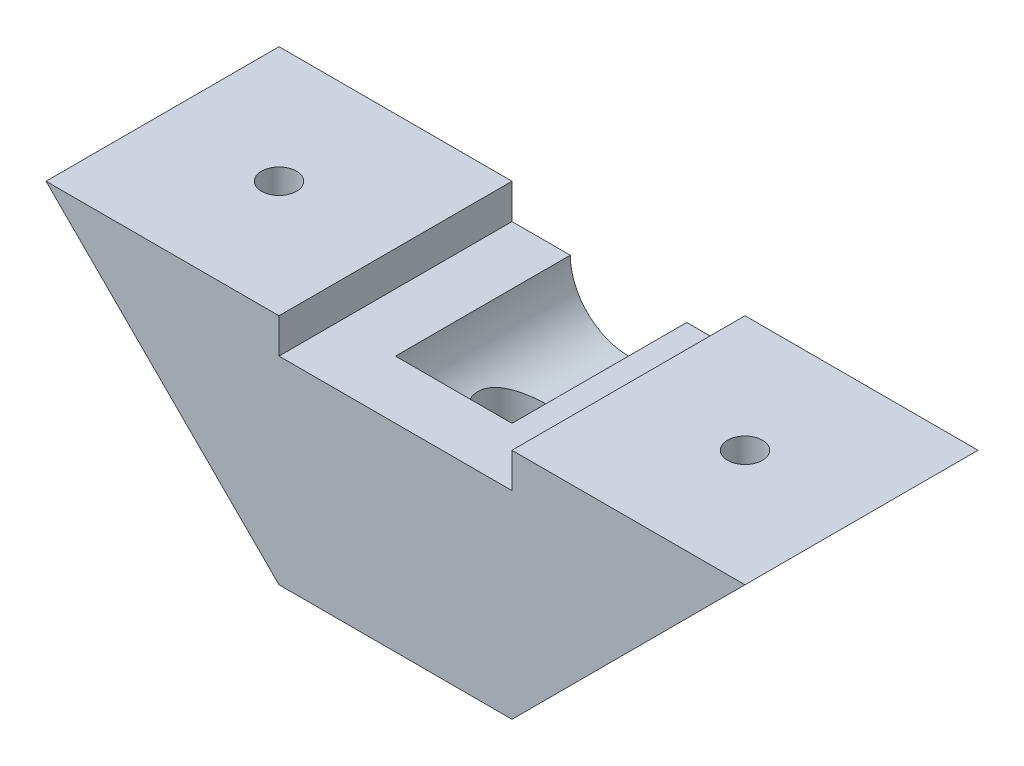
ISO-10303-21;
HEADER;
FILE_DESCRIPTION(('STEP AP214'),'2;1');
FILE_NAME('part.step','',(''),(''),'','','');
FILE_SCHEMA(('AUTOMOTIVE_DESIGN { 1 0 10303 214 1 1 1 1 }'));
ENDSEC;
DATA;
#1=APPLICATION_CONTEXT('core data for automotive mechanical design processes');
#2=APPLICATION_PROTOCOL_DEFINITION('international standard','automotive_design',2000,#1);
#3=PRODUCT_CONTEXT('',#1,'mechanical');
#4=PRODUCT('Part','Part','',(#3));
#5=PRODUCT_RELATED_PRODUCT_CATEGORY('part','',(#4));
#6=PRODUCT_DEFINITION_FORMATION('','',#4);
#7=PRODUCT_DEFINITION_CONTEXT('part definition',#1,'design');
#8=PRODUCT_DEFINITION('design','',#6,#7);
#9=PRODUCT_DEFINITION_SHAPE('','',#8);
#10=(LENGTH_UNIT() NAMED_UNIT(*) SI_UNIT(.MILLI.,.METRE.));
#11=(NAMED_UNIT(*) PLANE_ANGLE_UNIT() SI_UNIT($,.RADIAN.));
#12=(NAMED_UNIT(*) SI_UNIT($,.STERADIAN.) SOLID_ANGLE_UNIT());
#13=UNCERTAINTY_MEASURE_WITH_UNIT(LENGTH_MEASURE(1.E-05),#10,'distance_accuracy_value','');
#14=(GEOMETRIC_REPRESENTATION_CONTEXT(3) GLOBAL_UNCERTAINTY_ASSIGNED_CONTEXT((#13)) GLOBAL_UNIT_ASSIGNED_CONTEXT((#10,
#11,#12)) REPRESENTATION_CONTEXT('',''));
#15=CARTESIAN_POINT('',(0.,0.,0.));
#16=DIRECTION('',(0.,0.,1.));
#17=DIRECTION('',(1.,0.,0.));
#18=AXIS2_PLACEMENT_3D('',#15,#16,#17);
#19=CARTESIAN_POINT('',(10.,8.,10.));
#20=DIRECTION('',(0.,1.,0.));
#21=DIRECTION('',(0.,0.,1.));
#22=AXIS2_PLACEMENT_3D('',#19,#20,#21);
#23=CYLINDRICAL_SURFACE('',#22,1.5);
#24=CARTESIAN_POINT('',(10.,20.,10.));
#25=DIRECTION('',(0.,1.,0.));
#26=DIRECTION('',(0.,0.,1.));
#27=AXIS2_PLACEMENT_3D('',#24,#25,#26);
#28=CIRCLE('',#27,1.5);
#29=CARTESIAN_POINT('',(10.,20.,11.5));
#30=VERTEX_POINT('',#29);
#31=EDGE_CURVE('E225',#30,#30,#28,.T.);
#32=ORIENTED_EDGE('',*,*,#31,.T.);
#33=EDGE_LOOP('',(#32));
#34=FACE_BOUND('',#33,.T.);
#35=CARTESIAN_POINT('',(10.,15.,10.));
#36=DIRECTION('',(0.,-1.,0.));
#37=DIRECTION('',(0.,0.,-1.));
#38=AXIS2_PLACEMENT_3D('',#35,#36,#37);
#39=CIRCLE('',#38,1.5);
#40=CARTESIAN_POINT('',(10.,15.,8.5));
#41=VERTEX_POINT('',#40);
#42=EDGE_CURVE('E210',#41,#41,#39,.T.);
#43=ORIENTED_EDGE('',*,*,#42,.T.);
#44=EDGE_LOOP('',(#43));
#45=FACE_BOUND('',#44,.T.);
#46=ADVANCED_FACE('F41',(#34,#45),#23,.F.);
#47=CARTESIAN_POINT('',(50.,8.,10.));
#48=DIRECTION('',(0.,1.,0.));
#49=DIRECTION('',(0.,0.,1.));
#50=AXIS2_PLACEMENT_3D('',#47,#48,#49);
#51=CYLINDRICAL_SURFACE('',#50,1.5);
#52=CARTESIAN_POINT('',(50.,20.,10.));
#53=DIRECTION('',(0.,1.,0.));
#54=DIRECTION('',(0.,0.,1.));
#55=AXIS2_PLACEMENT_3D('',#52,#53,#54);
#56=CIRCLE('',#55,1.5);
#57=CARTESIAN_POINT('',(50.,20.,11.5));
#58=VERTEX_POINT('',#57);
#59=EDGE_CURVE('E272',#58,#58,#56,.T.);
#60=ORIENTED_EDGE('',*,*,#59,.T.);
#61=EDGE_LOOP('',(#60));
#62=FACE_BOUND('',#61,.T.);
#63=CARTESIAN_POINT('',(50.,15.,10.));
#64=DIRECTION('',(0.,-1.,0.));
#65=DIRECTION('',(0.,0.,-1.));
#66=AXIS2_PLACEMENT_3D('',#63,#64,#65);
#67=CIRCLE('',#66,1.5);
#68=CARTESIAN_POINT('',(50.,15.,8.49999999999999));
#69=VERTEX_POINT('',#68);
#70=EDGE_CURVE('E236',#69,#69,#67,.T.);
#71=ORIENTED_EDGE('',*,*,#70,.T.);
#72=EDGE_LOOP('',(#71));
#73=FACE_BOUND('',#72,.T.);
#74=ADVANCED_FACE('F390',(#62,#73),#51,.F.);
#75=CARTESIAN_POINT('',(30.,0.,10.));
#76=DIRECTION('',(0.,1.,0.));
#77=DIRECTION('',(0.,0.,1.));
#78=AXIS2_PLACEMENT_3D('',#75,#76,#77);
#79=CYLINDRICAL_SURFACE('',#78,1.6);
#80=CARTESIAN_POINT('',(30.,0.,10.));
#81=DIRECTION('',(0.,1.,0.));
#82=DIRECTION('',(0.,0.,1.));
#83=AXIS2_PLACEMENT_3D('',#80,#81,#82);
#84=CIRCLE('',#83,1.6);
#85=CARTESIAN_POINT('',(30.,0.,11.6));
#86=VERTEX_POINT('',#85);
#87=EDGE_CURVE('E284',#86,#86,#84,.T.);
#88=ORIENTED_EDGE('',*,*,#87,.F.);
#89=EDGE_LOOP('',(#88));
#90=FACE_BOUND('',#89,.T.);
#91=CARTESIAN_POINT('',(30.,8.,10.));
#92=DIRECTION('',(0.,1.,0.));
#93=DIRECTION('',(0.,0.,1.));
#94=AXIS2_PLACEMENT_3D('',#91,#92,#93);
#95=CIRCLE('',#94,1.6);
#96=CARTESIAN_POINT('',(30.,8.,11.6));
#97=VERTEX_POINT('',#96);
#98=EDGE_CURVE('E275',#97,#97,#95,.T.);
#99=ORIENTED_EDGE('',*,*,#98,.T.);
#100=EDGE_LOOP('',(#99));
#101=FACE_BOUND('',#100,.T.);
#102=ADVANCED_FACE('F387',(#90,#101),#79,.F.);
#103=CARTESIAN_POINT('',(10.,10.,15.));
#104=DIRECTION('',(0.707106781186547,0.707106781186547,0.));
#105=DIRECTION('',(-0.707106781186548,0.707106781186548,0.));
#106=AXIS2_PLACEMENT_3D('',#103,#104,#105);
#107=PLANE('',#106);
#108=DIRECTION('',(-0.654653670707977,0.654653670707977,-0.377964473009227));
#109=VECTOR('',#108,1.);
#110=CARTESIAN_POINT('',(12.0086077196921,7.99139228030794,8.04197875403658));
#111=LINE('',#110,#109);
#112=CARTESIAN_POINT('',(12.7,7.3,8.44115427318801));
#113=VERTEX_POINT('',#112);
#114=CARTESIAN_POINT('',(10.,9.99999999999999,6.88230854637602));
#115=VERTEX_POINT('',#114);
#116=EDGE_CURVE('E742',#113,#115,#111,.T.);
#117=ORIENTED_EDGE('',*,*,#116,.T.);
#118=DIRECTION('',(-0.654653670707977,0.654653670707977,0.377964473009227));
#119=VECTOR('',#118,1.);
#120=CARTESIAN_POINT('',(7.99139228030795,12.0086077196921,8.04197875403659));
#121=LINE('',#120,#119);
#122=CARTESIAN_POINT('',(7.3,12.7,8.44115427318801));
#123=VERTEX_POINT('',#122);
#124=EDGE_CURVE('E11',#115,#123,#121,.T.);
#125=ORIENTED_EDGE('',*,*,#124,.T.);
#126=DIRECTION('',(0.,0.,1.));
#127=VECTOR('',#126,1.);
#128=CARTESIAN_POINT('',(7.3,12.7,15.));
#129=LINE('',#128,#127);
#130=CARTESIAN_POINT('',(7.3,12.7,11.558845726812));
#131=VERTEX_POINT('',#130);
#132=EDGE_CURVE('E49',#123,#131,#129,.T.);
#133=ORIENTED_EDGE('',*,*,#132,.T.);
#134=DIRECTION('',(0.654653670707977,-0.654653670707977,0.377964473009227));
#135=VECTOR('',#134,1.);
#136=CARTESIAN_POINT('',(10.4657505768349,9.53424942316509,13.3865926745348));
#137=LINE('',#136,#135);
#138=CARTESIAN_POINT('',(10.,9.99999999999999,13.117691453624));
#139=VERTEX_POINT('',#138);
#140=EDGE_CURVE('E754',#131,#139,#137,.T.);
#141=ORIENTED_EDGE('',*,*,#140,.T.);
#142=DIRECTION('',(0.654653670707977,-0.654653670707977,-0.377964473009227));
#143=VECTOR('',#142,1.);
#144=CARTESIAN_POINT('',(9.53424942316509,10.4657505768349,13.3865926745348));
#145=LINE('',#144,#143);
#146=CARTESIAN_POINT('',(12.7,7.3,11.558845726812));
#147=VERTEX_POINT('',#146);
#148=EDGE_CURVE('E751',#139,#147,#145,.T.);
#149=ORIENTED_EDGE('',*,*,#148,.T.);
#150=DIRECTION('',(0.,0.,-1.));
#151=VECTOR('',#150,1.);
#152=CARTESIAN_POINT('',(12.7,7.3,15.));
#153=LINE('',#152,#151);
#154=EDGE_CURVE('E748',#147,#113,#153,.T.);
#155=ORIENTED_EDGE('',*,*,#154,.T.);
#156=EDGE_LOOP('',(#117,#125,#133,#141,#149,#155));
#157=FACE_BOUND('',#156,.T.);
#158=DIRECTION('',(0.707106781186548,-0.707106781186548,0.));
#159=VECTOR('',#158,1.);
#160=CARTESIAN_POINT('',(10.,10.,0.));
#161=LINE('',#160,#159);
#162=CARTESIAN_POINT('',(0.,20.,0.));
#163=VERTEX_POINT('',#162);
#164=CARTESIAN_POINT('',(20.,0.,0.));
#165=VERTEX_POINT('',#164);
#166=EDGE_CURVE('E312',#163,#165,#161,.T.);
#167=ORIENTED_EDGE('',*,*,#166,.T.);
#168=DIRECTION('',(0.,0.,-1.));
#169=VECTOR('',#168,1.);
#170=CARTESIAN_POINT('',(20.,0.,15.));
#171=LINE('',#170,#169);
#172=CARTESIAN_POINT('',(20.,0.,20.));
#173=VERTEX_POINT('',#172);
#174=EDGE_CURVE('E362',#173,#165,#171,.T.);
#175=ORIENTED_EDGE('',*,*,#174,.F.);
#176=DIRECTION('',(0.707106781186548,-0.707106781186548,0.));
#177=VECTOR('',#176,1.);
#178=CARTESIAN_POINT('',(10.,10.,20.));
#179=LINE('',#178,#177);
#180=CARTESIAN_POINT('',(0.,20.,20.));
#181=VERTEX_POINT('',#180);
#182=EDGE_CURVE('E297',#181,#173,#179,.T.);
#183=ORIENTED_EDGE('',*,*,#182,.F.);
#184=DIRECTION('',(0.,0.,-1.));
#185=VECTOR('',#184,1.);
#186=CARTESIAN_POINT('',(0.,20.,15.));
#187=LINE('',#186,#185);
#188=EDGE_CURVE('E317',#181,#163,#187,.T.);
#189=ORIENTED_EDGE('',*,*,#188,.T.);
#190=EDGE_LOOP('',(#167,#175,#183,#189));
#191=FACE_BOUND('',#190,.T.);
#192=ADVANCED_FACE('F43',(#157,#191),#107,.F.);
#193=CARTESIAN_POINT('',(0.,0.,15.));
#194=DIRECTION('',(0.,1.,0.));
#195=DIRECTION('',(0.,0.,1.));
#196=AXIS2_PLACEMENT_3D('',#193,#194,#195);
#197=PLANE('',#196);
#198=ORIENTED_EDGE('',*,*,#87,.T.);
#199=EDGE_LOOP('',(#198));
#200=FACE_BOUND('',#199,.T.);
#201=DIRECTION('',(1.,0.,0.));
#202=VECTOR('',#201,1.);
#203=CARTESIAN_POINT('',(0.,0.,0.));
#204=LINE('',#203,#202);
#205=CARTESIAN_POINT('',(40.,0.,0.));
#206=VERTEX_POINT('',#205);
#207=EDGE_CURVE('E321',#165,#206,#204,.T.);
#208=ORIENTED_EDGE('',*,*,#207,.T.);
#209=DIRECTION('',(0.,0.,-1.));
#210=VECTOR('',#209,1.);
#211=CARTESIAN_POINT('',(40.,0.,15.));
#212=LINE('',#211,#210);
#213=CARTESIAN_POINT('',(40.,0.,20.));
#214=VERTEX_POINT('',#213);
#215=EDGE_CURVE('E359',#214,#206,#212,.T.);
#216=ORIENTED_EDGE('',*,*,#215,.F.);
#217=DIRECTION('',(1.,0.,0.));
#218=VECTOR('',#217,1.);
#219=CARTESIAN_POINT('',(0.,0.,20.));
#220=LINE('',#219,#218);
#221=EDGE_CURVE('E300',#173,#214,#220,.T.);
#222=ORIENTED_EDGE('',*,*,#221,.F.);
#223=ORIENTED_EDGE('',*,*,#174,.T.);
#224=EDGE_LOOP('',(#208,#216,#222,#223));
#225=FACE_BOUND('',#224,.T.);
#226=ADVANCED_FACE('F541',(#200,#225),#197,.F.);
#227=CARTESIAN_POINT('',(20.,-20.,15.));
#228=DIRECTION('',(-0.707106781186547,0.707106781186547,0.));
#229=DIRECTION('',(-0.707106781186548,-0.707106781186548,0.));
#230=AXIS2_PLACEMENT_3D('',#227,#228,#229);
#231=PLANE('',#230);
#232=DIRECTION('',(-0.654653670707977,-0.654653670707977,-0.377964473009227));
#233=VECTOR('',#232,1.);
#234=CARTESIAN_POINT('',(26.2943220054063,-13.7056779945937,-6.80417102512521));
#235=LINE('',#234,#233);
#236=CARTESIAN_POINT('',(52.7,12.7,8.44115427318801));
#237=VERTEX_POINT('',#236);
#238=CARTESIAN_POINT('',(50.,10.,6.88230854637603));
#239=VERTEX_POINT('',#238);
#240=EDGE_CURVE('E365',#237,#239,#235,.T.);
#241=ORIENTED_EDGE('',*,*,#240,.T.);
#242=DIRECTION('',(-0.654653670707977,-0.654653670707977,0.377964473009227));
#243=VECTOR('',#242,1.);
#244=CARTESIAN_POINT('',(22.2771065660222,-17.7228934339778,22.8881285331984));
#245=LINE('',#244,#243);
#246=CARTESIAN_POINT('',(47.3,7.30000000000001,8.44115427318801));
#247=VERTEX_POINT('',#246);
#248=EDGE_CURVE('E729',#239,#247,#245,.T.);
#249=ORIENTED_EDGE('',*,*,#248,.T.);
#250=DIRECTION('',(0.,0.,1.));
#251=VECTOR('',#250,1.);
#252=CARTESIAN_POINT('',(47.3,7.30000000000001,15.));
#253=LINE('',#252,#251);
#254=CARTESIAN_POINT('',(47.3,7.3,11.558845726812));
#255=VERTEX_POINT('',#254);
#256=EDGE_CURVE('E740',#247,#255,#253,.T.);
#257=ORIENTED_EDGE('',*,*,#256,.T.);
#258=DIRECTION('',(0.654653670707977,0.654653670707977,0.377964473009227));
#259=VECTOR('',#258,1.);
#260=CARTESIAN_POINT('',(24.7514648625492,-15.2485351374508,-1.45955710462697));
#261=LINE('',#260,#259);
#262=CARTESIAN_POINT('',(50.,10.,13.117691453624));
#263=VERTEX_POINT('',#262);
#264=EDGE_CURVE('E738',#255,#263,#261,.T.);
#265=ORIENTED_EDGE('',*,*,#264,.T.);
#266=DIRECTION('',(0.654653670707977,0.654653670707977,-0.377964473009227));
#267=VECTOR('',#266,1.);
#268=CARTESIAN_POINT('',(23.8199637088794,-16.1800362911206,28.2327424536967));
#269=LINE('',#268,#267);
#270=CARTESIAN_POINT('',(52.7,12.7,11.558845726812));
#271=VERTEX_POINT('',#270);
#272=EDGE_CURVE('E736',#263,#271,#269,.T.);
#273=ORIENTED_EDGE('',*,*,#272,.T.);
#274=DIRECTION('',(0.,0.,-1.));
#275=VECTOR('',#274,1.);
#276=CARTESIAN_POINT('',(52.7,12.7,15.));
#277=LINE('',#276,#275);
#278=EDGE_CURVE('E759',#271,#237,#277,.T.);
#279=ORIENTED_EDGE('',*,*,#278,.T.);
#280=EDGE_LOOP('',(#241,#249,#257,#265,#273,#279));
#281=FACE_BOUND('',#280,.T.);
#282=DIRECTION('',(0.707106781186548,0.707106781186548,0.));
#283=VECTOR('',#282,1.);
#284=CARTESIAN_POINT('',(20.,-20.,0.));
#285=LINE('',#284,#283);
#286=CARTESIAN_POINT('',(60.,20.,0.));
#287=VERTEX_POINT('',#286);
#288=EDGE_CURVE('E323',#206,#287,#285,.T.);
#289=ORIENTED_EDGE('',*,*,#288,.T.);
#290=DIRECTION('',(0.,0.,-1.));
#291=VECTOR('',#290,1.);
#292=CARTESIAN_POINT('',(60.,20.,15.));
#293=LINE('',#292,#291);
#294=CARTESIAN_POINT('',(60.,20.,20.));
#295=VERTEX_POINT('',#294);
#296=EDGE_CURVE('E356',#295,#287,#293,.T.);
#297=ORIENTED_EDGE('',*,*,#296,.F.);
#298=DIRECTION('',(0.707106781186548,0.707106781186548,0.));
#299=VECTOR('',#298,1.);
#300=CARTESIAN_POINT('',(20.,-20.,20.));
#301=LINE('',#300,#299);
#302=EDGE_CURVE('E303',#214,#295,#301,.T.);
#303=ORIENTED_EDGE('',*,*,#302,.F.);
#304=ORIENTED_EDGE('',*,*,#215,.T.);
#305=EDGE_LOOP('',(#289,#297,#303,#304));
#306=FACE_BOUND('',#305,.T.);
#307=ADVANCED_FACE('F536',(#281,#306),#231,.F.);
#308=CARTESIAN_POINT('',(0.,20.,15.));
#309=DIRECTION('',(0.,-1.,0.));
#310=DIRECTION('',(0.,0.,-1.));
#311=AXIS2_PLACEMENT_3D('',#308,#309,#310);
#312=PLANE('',#311);
#313=ORIENTED_EDGE('',*,*,#59,.F.);
#314=EDGE_LOOP('',(#313));
#315=FACE_BOUND('',#314,.T.);
#316=DIRECTION('',(-1.,0.,0.));
#317=VECTOR('',#316,1.);
#318=CARTESIAN_POINT('',(0.,20.,0.));
#319=LINE('',#318,#317);
#320=CARTESIAN_POINT('',(40.,20.,0.));
#321=VERTEX_POINT('',#320);
#322=EDGE_CURVE('E325',#287,#321,#319,.T.);
#323=ORIENTED_EDGE('',*,*,#322,.T.);
#324=DIRECTION('',(0.,0.,-1.));
#325=VECTOR('',#324,1.);
#326=CARTESIAN_POINT('',(40.,20.,15.));
#327=LINE('',#326,#325);
#328=CARTESIAN_POINT('',(40.,20.,20.));
#329=VERTEX_POINT('',#328);
#330=EDGE_CURVE('E354',#329,#321,#327,.T.);
#331=ORIENTED_EDGE('',*,*,#330,.F.);
#332=DIRECTION('',(-1.,0.,0.));
#333=VECTOR('',#332,1.);
#334=CARTESIAN_POINT('',(0.,20.,20.));
#335=LINE('',#334,#333);
#336=EDGE_CURVE('E306',#295,#329,#335,.T.);
#337=ORIENTED_EDGE('',*,*,#336,.F.);
#338=ORIENTED_EDGE('',*,*,#296,.T.);
#339=EDGE_LOOP('',(#323,#331,#337,#338));
#340=FACE_BOUND('',#339,.T.);
#341=ADVANCED_FACE('F540',(#315,#340),#312,.F.);
#342=CARTESIAN_POINT('',(40.,0.,15.));
#343=DIRECTION('',(-1.,0.,0.));
#344=DIRECTION('',(0.,0.,1.));
#345=AXIS2_PLACEMENT_3D('',#342,#343,#344);
#346=PLANE('',#345);
#347=DIRECTION('',(0.,1.,0.));
#348=VECTOR('',#347,1.);
#349=CARTESIAN_POINT('',(40.,0.,0.));
#350=LINE('',#349,#348);
#351=CARTESIAN_POINT('',(40.,17.,0.));
#352=VERTEX_POINT('',#351);
#353=EDGE_CURVE('E328',#352,#321,#350,.T.);
#354=ORIENTED_EDGE('',*,*,#353,.F.);
#355=DIRECTION('',(0.,0.,-1.));
#356=VECTOR('',#355,1.);
#357=CARTESIAN_POINT('',(40.,17.,15.));
#358=LINE('',#357,#356);
#359=CARTESIAN_POINT('',(40.,17.,20.));
#360=VERTEX_POINT('',#359);
#361=EDGE_CURVE('E352',#360,#352,#358,.T.);
#362=ORIENTED_EDGE('',*,*,#361,.F.);
#363=DIRECTION('',(0.,-1.,0.));
#364=VECTOR('',#363,1.);
#365=CARTESIAN_POINT('',(40.,0.,20.));
#366=LINE('',#365,#364);
#367=EDGE_CURVE('E309',#329,#360,#366,.T.);
#368=ORIENTED_EDGE('',*,*,#367,.F.);
#369=ORIENTED_EDGE('',*,*,#330,.T.);
#370=EDGE_LOOP('',(#354,#362,#368,#369));
#371=FACE_BOUND('',#370,.T.);
#372=ADVANCED_FACE('F417',(#371),#346,.T.);
#373=CARTESIAN_POINT('',(30.,17.,15.));
#374=DIRECTION('',(0.,0.,-1.));
#375=DIRECTION('',(-1.,0.,0.));
#376=AXIS2_PLACEMENT_3D('',#373,#374,#375);
#377=CYLINDRICAL_SURFACE('',#376,5.);
#378=CARTESIAN_POINT('',(30.,12.,12.9));
#379=CARTESIAN_POINT('',(30.1491967729885,12.0000078224276,12.8999913460749));
#380=CARTESIAN_POINT('',(30.2986264408849,12.0067508486508,12.8884077247479));
#381=CARTESIAN_POINT('',(30.5930082905297,12.0330790732113,12.8426469701946));
#382=CARTESIAN_POINT('',(30.7379489397803,12.0526948709138,12.8084160012506));
#383=CARTESIAN_POINT('',(31.018497114166,12.1027686908275,12.7192324821387));
#384=CARTESIAN_POINT('',(31.15414546244,12.1331751009535,12.66437850002));
#385=CARTESIAN_POINT('',(31.4139363459503,12.2022009636197,12.5360979987518));
#386=CARTESIAN_POINT('',(31.5380814818383,12.2408185532358,12.4626756916055));
#387=CARTESIAN_POINT('',(31.781664167236,12.3262936552959,12.2933100388347));
#388=CARTESIAN_POINT('',(31.9000844787323,12.3735482435072,12.1961077527812));
#389=CARTESIAN_POINT('',(32.1199322401329,12.4700624205489,11.9847373353088));
#390=CARTESIAN_POINT('',(32.2213390565927,12.5193243551591,11.870548915618));
#391=CARTESIAN_POINT('',(32.4158529590917,12.6208458684022,11.6132347371063));
#392=CARTESIAN_POINT('',(32.5067342483687,12.6728169617182,11.4682978326821));
#393=CARTESIAN_POINT('',(32.6624688799267,12.7668478304549,11.1621658773871));
#394=CARTESIAN_POINT('',(32.7273624884822,12.8089228970678,11.0009964665533));
#395=CARTESIAN_POINT('',(32.8163777072555,12.8683896182247,10.7044411435723));
#396=CARTESIAN_POINT('',(32.8464140272687,12.8892179827822,10.571521429339));
#397=CARTESIAN_POINT('',(32.8875103509005,12.9179735144379,10.3014684479495));
#398=CARTESIAN_POINT('',(32.8985916322946,12.9259151468838,10.1643400814952));
#399=CARTESIAN_POINT('',(32.9011575774588,12.9277415563378,9.8895965138722));
#400=CARTESIAN_POINT('',(32.8926122756599,12.9216048387513,9.75198088899865));
#401=CARTESIAN_POINT('',(32.8563823026139,12.8961545569601,9.48051577211027));
#402=CARTESIAN_POINT('',(32.8286840858592,12.8768316672316,9.34666901531648));
#403=CARTESIAN_POINT('',(32.7557814436854,12.8277632684891,9.08688749178438));
#404=CARTESIAN_POINT('',(32.7106891581575,12.7980846377882,8.96090793014022));
#405=CARTESIAN_POINT('',(32.6045905167577,12.7315079345349,8.71792813864537));
#406=CARTESIAN_POINT('',(32.5435781450092,12.6946071341919,8.60093132486902));
#407=CARTESIAN_POINT('',(32.3957601862419,12.6103886970534,8.35877248774962));
#408=CARTESIAN_POINT('',(32.3063615576764,12.5623563591747,8.23543892636786));
#409=CARTESIAN_POINT('',(32.1095899817114,12.4654994103952,8.00432543209664));
#410=CARTESIAN_POINT('',(32.0022011241215,12.4166741330582,7.89655942533857));
#411=CARTESIAN_POINT('',(31.7568119959212,12.3167175495974,7.68641179652703));
#412=CARTESIAN_POINT('',(31.6166794606572,12.2660232288844,7.58626333756245));
#413=CARTESIAN_POINT('',(31.3932311386571,12.1973938528245,7.45512397166658));
#414=CARTESIAN_POINT('',(31.3165062260764,12.1757454539997,7.4145788070903));
#415=CARTESIAN_POINT('',(31.159081472292,12.1355257557736,7.34028386732338));
#416=CARTESIAN_POINT('',(31.0783840882797,12.1169525844463,7.3065299555068));
#417=CARTESIAN_POINT('',(30.9191360511687,12.0845809752751,7.24829349888882));
#418=CARTESIAN_POINT('',(30.8408052940449,12.0705456169954,7.2233404871752));
#419=CARTESIAN_POINT('',(30.6818202270122,12.0460535752699,7.18008810472819));
#420=CARTESIAN_POINT('',(30.6011672095802,12.0355949413633,7.16178510726534));
#421=CARTESIAN_POINT('',(30.4382338566437,12.0185694752224,7.13210891431779));
#422=CARTESIAN_POINT('',(30.3559545557186,12.012000246131,7.12073145083083));
#423=CARTESIAN_POINT('',(30.1905301129917,12.0029431940495,7.10507124530189));
#424=CARTESIAN_POINT('',(30.1073850762502,12.0004548815019,7.10078765226017));
#425=CARTESIAN_POINT('',(29.878775894024,11.9993657143691,7.09890051401778));
#426=CARTESIAN_POINT('',(29.7331404639224,12.0050554988166,7.10867416450532));
#427=CARTESIAN_POINT('',(29.4460608192358,12.0286869554136,7.14969806389365));
#428=CARTESIAN_POINT('',(29.3046166358029,12.0466287186037,7.18094847238148));
#429=CARTESIAN_POINT('',(29.0315172192145,12.0927651568574,7.26283397543997));
#430=CARTESIAN_POINT('',(28.899751694071,12.1208109773282,7.31318817393764));
#431=CARTESIAN_POINT('',(28.6464913104896,12.1849084087168,7.43142633889752));
#432=CARTESIAN_POINT('',(28.5249987902661,12.2209618354912,7.49931428199431));
#433=CARTESIAN_POINT('',(28.2820627539389,12.3024721137827,7.65864564021442));
#434=CARTESIAN_POINT('',(28.1619456970136,12.3485175128806,7.75180725912356));
#435=CARTESIAN_POINT('',(27.9381188824625,12.4433065652966,7.95511647923601));
#436=CARTESIAN_POINT('',(27.8344284240277,12.4920533029503,8.06528376443459));
#437=CARTESIAN_POINT('',(27.6339663568175,12.5936489065787,8.31465128925723));
#438=CARTESIAN_POINT('',(27.5394329006398,12.6463082635231,8.45574125697765));
#439=CARTESIAN_POINT('',(27.3755632722842,12.7430741040824,8.75450314740166));
#440=CARTESIAN_POINT('',(27.3061952738992,12.7871913575342,8.91215379830348));
#441=CARTESIAN_POINT('',(27.2077335269395,12.8519943451444,9.20518596609019));
#442=CARTESIAN_POINT('',(27.1731872970952,12.8756785586661,9.33806771323553));
#443=CARTESIAN_POINT('',(27.123201109898,12.910381173359,9.60892948063831));
#444=CARTESIAN_POINT('',(27.1077379607178,12.9214149475546,9.74690310214983));
#445=CARTESIAN_POINT('',(27.0967723715415,12.9292108704562,10.0244058132625));
#446=CARTESIAN_POINT('',(27.1013195456951,12.9259375458814,10.1639379125482));
#447=CARTESIAN_POINT('',(27.1302023085067,12.9055460737932,10.439932858843));
#448=CARTESIAN_POINT('',(27.1545501435988,12.8884193581848,10.5763937526613));
#449=CARTESIAN_POINT('',(27.2208355073017,12.8433452703158,10.8391360652439));
#450=CARTESIAN_POINT('',(27.2623017005193,12.8156892875505,10.9655894988164));
#451=CARTESIAN_POINT('',(27.3611893537542,12.7526352226072,11.2099912446638));
#452=CARTESIAN_POINT('',(27.4186165469057,12.71723435947,11.3279364816148));
#453=CARTESIAN_POINT('',(27.5580430428587,12.6360216929627,11.571452806652));
#454=CARTESIAN_POINT('',(27.6424697839631,12.5894465726805,11.6953788754869));
#455=CARTESIAN_POINT('',(27.8290256568137,12.4946885505621,11.9285204741627));
#456=CARTESIAN_POINT('',(27.9311709301296,12.4465042153358,12.0377224277067));
#457=CARTESIAN_POINT('',(28.1667148440012,12.3462287320863,12.2534214445048));
#458=CARTESIAN_POINT('',(28.3024746196016,12.2944973585844,12.3575312534252));
#459=CARTESIAN_POINT('',(28.5924493479444,12.1997936765973,12.5412954344658));
#460=CARTESIAN_POINT('',(28.7466538229842,12.1568164323926,12.6209636000766));
#461=CARTESIAN_POINT('',(29.0406865197232,12.0910049417381,12.740481337281));
#462=CARTESIAN_POINT('',(29.1781682982747,12.0659446041804,12.7848999258579));
#463=CARTESIAN_POINT('',(29.4595409141461,12.0272817295834,12.852844691061));
#464=CARTESIAN_POINT('',(29.6034128661518,12.0136475246734,12.8764286214721));
#465=CARTESIAN_POINT('',(29.7901608506058,12.0042278174257,12.8927048708583));
#466=CARTESIAN_POINT('',(29.8320585179662,12.0026451024192,12.8954375135458));
#467=CARTESIAN_POINT('',(29.9159646205239,12.0005300185761,12.8990864238813));
#468=CARTESIAN_POINT('',(29.9579730703791,11.9999977965166,12.9000024377062));
#469=CARTESIAN_POINT('',(30.,12.,12.9));
#470=B_SPLINE_CURVE_WITH_KNOTS('',3,(#378,#379,#380,#381,#382,#383,#384,#385,#386,#387,#388,
#389,#390,#391,#392,#393,#394,#395,#396,#397,#398,#399,#400,#401,#402,#403,#404,#405,#406,#407,
#408,#409,#410,#411,#412,#413,#414,#415,#416,#417,#418,#419,#420,#421,#422,#423,#424,#425,#426,
#427,#428,#429,#430,#431,#432,#433,#434,#435,#436,#437,#438,#439,#440,#441,#442,#443,#444,#445,
#446,#447,#448,#449,#450,#451,#452,#453,#454,#455,#456,#457,#458,#459,#460,#461,#462,#463,#464,
#465,#466,#467,#468,#469),.UNSPECIFIED.,.T.,.F.,(4,2,2,2,2,2,2,2,2,2,2,2,2,2,2,2,2,2,2,2,2,2,2,
2,2,2,2,2,2,2,2,2,2,2,2,2,2,2,2,2,2,2,2,2,2,4),(0.,0.447413964824487,0.895895331206737,
1.34225987460748,1.78852325621131,2.2675980237824,2.7472496632287,3.28099528463669,
3.81391067100087,4.22569525629178,4.6370172931255,5.04896774757999,5.46120984394625,
5.87083746707253,6.28062010487514,6.75788862556959,7.23558148283924,7.77113360988879,
8.03912763723573,8.30695792899624,8.5567980380324,8.80650168609388,9.05605129295394,
9.30557096100433,9.74142299283888,10.1772782633875,10.6069587476606,11.0367367687155,
11.5113354389487,11.986487632698,12.5173731172902,13.0475848425436,13.4637983421371,
13.8795055142713,14.2962439822285,14.713240393345,15.1194492164737,15.5258041373517,
15.9950511885486,16.4647279903217,16.9982748937395,17.5315201370124,17.9695902447882,
18.4064421746773,18.5324556810902,18.6584867931205),.UNSPECIFIED.);
#471=CARTESIAN_POINT('',(30.,12.,12.9));
#472=VERTEX_POINT('',#471);
#473=EDGE_CURVE('E283',#472,#472,#470,.T.);
#474=ORIENTED_EDGE('',*,*,#473,.F.);
#475=EDGE_LOOP('',(#474));
#476=FACE_BOUND('',#475,.T.);
#477=CARTESIAN_POINT('',(30.,17.,0.));
#478=DIRECTION('',(0.,0.,1.));
#479=DIRECTION('',(1.,0.,0.));
#480=AXIS2_PLACEMENT_3D('',#477,#478,#479);
#481=CIRCLE('',#480,5.);
#482=CARTESIAN_POINT('',(25.,17.,0.));
#483=VERTEX_POINT('',#482);
#484=CARTESIAN_POINT('',(35.,17.,0.));
#485=VERTEX_POINT('',#484);
#486=EDGE_CURVE('E334',#483,#485,#481,.T.);
#487=ORIENTED_EDGE('',*,*,#486,.F.);
#488=DIRECTION('',(0.,0.,-1.));
#489=VECTOR('',#488,1.);
#490=CARTESIAN_POINT('',(25.,17.,15.));
#491=LINE('',#490,#489);
#492=CARTESIAN_POINT('',(25.,17.,15.));
#493=VERTEX_POINT('',#492);
#494=EDGE_CURVE('E348',#493,#483,#491,.T.);
#495=ORIENTED_EDGE('',*,*,#494,.F.);
#496=CARTESIAN_POINT('',(30.,17.,15.));
#497=DIRECTION('',(0.,0.,1.));
#498=DIRECTION('',(1.,0.,0.));
#499=AXIS2_PLACEMENT_3D('',#496,#497,#498);
#500=CIRCLE('',#499,5.);
#501=CARTESIAN_POINT('',(35.,17.,15.));
#502=VERTEX_POINT('',#501);
#503=EDGE_CURVE('E314',#493,#502,#500,.T.);
#504=ORIENTED_EDGE('',*,*,#503,.T.);
#505=DIRECTION('',(0.,0.,-1.));
#506=VECTOR('',#505,1.);
#507=CARTESIAN_POINT('',(35.,17.,15.));
#508=LINE('',#507,#506);
#509=EDGE_CURVE('E350',#502,#485,#508,.T.);
#510=ORIENTED_EDGE('',*,*,#509,.T.);
#511=EDGE_LOOP('',(#487,#495,#504,#510));
#512=FACE_BOUND('',#511,.T.);
#513=ADVANCED_FACE('F374',(#476,#512),#377,.F.);
#514=CARTESIAN_POINT('',(0.,17.,15.));
#515=DIRECTION('',(0.,1.,0.));
#516=DIRECTION('',(0.,0.,1.));
#517=AXIS2_PLACEMENT_3D('',#514,#515,#516);
#518=PLANE('',#517);
#519=DIRECTION('',(1.,0.,0.));
#520=VECTOR('',#519,1.);
#521=CARTESIAN_POINT('',(0.,17.,0.));
#522=LINE('',#521,#520);
#523=CARTESIAN_POINT('',(20.,17.,0.));
#524=VERTEX_POINT('',#523);
#525=EDGE_CURVE('E335',#524,#483,#522,.T.);
#526=ORIENTED_EDGE('',*,*,#525,.F.);
#527=DIRECTION('',(0.,0.,-1.));
#528=VECTOR('',#527,1.);
#529=CARTESIAN_POINT('',(20.,17.,15.));
#530=LINE('',#529,#528);
#531=CARTESIAN_POINT('',(20.,17.,20.));
#532=VERTEX_POINT('',#531);
#533=EDGE_CURVE('E346',#532,#524,#530,.T.);
#534=ORIENTED_EDGE('',*,*,#533,.F.);
#535=DIRECTION('',(1.,0.,0.));
#536=VECTOR('',#535,1.);
#537=CARTESIAN_POINT('',(0.,17.,20.));
#538=LINE('',#537,#536);
#539=EDGE_CURVE('E288',#532,#360,#538,.T.);
#540=ORIENTED_EDGE('',*,*,#539,.T.);
#541=ORIENTED_EDGE('',*,*,#361,.T.);
#542=EDGE_CURVE('E331',#485,#352,#522,.T.);
#543=ORIENTED_EDGE('',*,*,#542,.F.);
#544=ORIENTED_EDGE('',*,*,#509,.F.);
#545=DIRECTION('',(1.,0.,0.));
#546=VECTOR('',#545,1.);
#547=CARTESIAN_POINT('',(0.,17.,15.));
#548=LINE('',#547,#546);
#549=EDGE_CURVE('E287',#493,#502,#548,.T.);
#550=ORIENTED_EDGE('',*,*,#549,.F.);
#551=ORIENTED_EDGE('',*,*,#494,.T.);
#552=EDGE_LOOP('',(#526,#534,#540,#541,#543,#544,#550,#551));
#553=FACE_BOUND('',#552,.T.);
#554=ADVANCED_FACE('F409',(#553),#518,.T.);
#555=CARTESIAN_POINT('',(20.,0.,15.));
#556=DIRECTION('',(-1.,0.,0.));
#557=DIRECTION('',(0.,0.,1.));
#558=AXIS2_PLACEMENT_3D('',#555,#556,#557);
#559=PLANE('',#558);
#560=DIRECTION('',(0.,1.,0.));
#561=VECTOR('',#560,1.);
#562=CARTESIAN_POINT('',(20.,0.,0.));
#563=LINE('',#562,#561);
#564=CARTESIAN_POINT('',(20.,20.,0.));
#565=VERTEX_POINT('',#564);
#566=EDGE_CURVE('E338',#524,#565,#563,.T.);
#567=ORIENTED_EDGE('',*,*,#566,.T.);
#568=DIRECTION('',(0.,0.,-1.));
#569=VECTOR('',#568,1.);
#570=CARTESIAN_POINT('',(20.,20.,15.));
#571=LINE('',#570,#569);
#572=CARTESIAN_POINT('',(20.,20.,20.));
#573=VERTEX_POINT('',#572);
#574=EDGE_CURVE('E344',#573,#565,#571,.T.);
#575=ORIENTED_EDGE('',*,*,#574,.F.);
#576=DIRECTION('',(0.,1.,0.));
#577=VECTOR('',#576,1.);
#578=CARTESIAN_POINT('',(20.,0.,20.));
#579=LINE('',#578,#577);
#580=EDGE_CURVE('E291',#532,#573,#579,.T.);
#581=ORIENTED_EDGE('',*,*,#580,.F.);
#582=ORIENTED_EDGE('',*,*,#533,.T.);
#583=EDGE_LOOP('',(#567,#575,#581,#582));
#584=FACE_BOUND('',#583,.T.);
#585=ADVANCED_FACE('F406',(#584),#559,.F.);
#586=CARTESIAN_POINT('',(0.,20.,15.));
#587=DIRECTION('',(0.,1.,0.));
#588=DIRECTION('',(0.,0.,1.));
#589=AXIS2_PLACEMENT_3D('',#586,#587,#588);
#590=PLANE('',#589);
#591=ORIENTED_EDGE('',*,*,#31,.F.);
#592=EDGE_LOOP('',(#591));
#593=FACE_BOUND('',#592,.T.);
#594=DIRECTION('',(1.,0.,0.));
#595=VECTOR('',#594,1.);
#596=CARTESIAN_POINT('',(0.,20.,0.));
#597=LINE('',#596,#595);
#598=EDGE_CURVE('E318',#163,#565,#597,.T.);
#599=ORIENTED_EDGE('',*,*,#598,.F.);
#600=ORIENTED_EDGE('',*,*,#188,.F.);
#601=DIRECTION('',(-1.,0.,0.));
#602=VECTOR('',#601,1.);
#603=CARTESIAN_POINT('',(0.,20.,20.));
#604=LINE('',#603,#602);
#605=EDGE_CURVE('E294',#573,#181,#604,.T.);
#606=ORIENTED_EDGE('',*,*,#605,.F.);
#607=ORIENTED_EDGE('',*,*,#574,.T.);
#608=EDGE_LOOP('',(#599,#600,#606,#607));
#609=FACE_BOUND('',#608,.T.);
#610=ADVANCED_FACE('F402',(#593,#609),#590,.T.);
#611=CARTESIAN_POINT('',(0.,0.,0.));
#612=DIRECTION('',(0.,0.,1.));
#613=DIRECTION('',(1.,0.,0.));
#614=AXIS2_PLACEMENT_3D('',#611,#612,#613);
#615=PLANE('',#614);
#616=ORIENTED_EDGE('',*,*,#166,.F.);
#617=ORIENTED_EDGE('',*,*,#598,.T.);
#618=ORIENTED_EDGE('',*,*,#566,.F.);
#619=ORIENTED_EDGE('',*,*,#525,.T.);
#620=ORIENTED_EDGE('',*,*,#486,.T.);
#621=ORIENTED_EDGE('',*,*,#542,.T.);
#622=ORIENTED_EDGE('',*,*,#353,.T.);
#623=ORIENTED_EDGE('',*,*,#322,.F.);
#624=ORIENTED_EDGE('',*,*,#288,.F.);
#625=ORIENTED_EDGE('',*,*,#207,.F.);
#626=EDGE_LOOP('',(#616,#617,#618,#619,#620,#621,#622,#623,#624,#625));
#627=FACE_BOUND('',#626,.T.);
#628=ADVANCED_FACE('F398',(#627),#615,.F.);
#629=CARTESIAN_POINT('',(0.,0.,15.));
#630=DIRECTION('',(0.,0.,1.));
#631=DIRECTION('',(1.,0.,0.));
#632=AXIS2_PLACEMENT_3D('',#629,#630,#631);
#633=PLANE('',#632);
#634=ORIENTED_EDGE('',*,*,#503,.F.);
#635=ORIENTED_EDGE('',*,*,#549,.T.);
#636=EDGE_LOOP('',(#634,#635));
#637=FACE_BOUND('',#636,.T.);
#638=ADVANCED_FACE('F394',(#637),#633,.F.);
#639=CARTESIAN_POINT('',(0.,0.,20.));
#640=DIRECTION('',(0.,0.,1.));
#641=DIRECTION('',(1.,0.,0.));
#642=AXIS2_PLACEMENT_3D('',#639,#640,#641);
#643=PLANE('',#642);
#644=ORIENTED_EDGE('',*,*,#539,.F.);
#645=ORIENTED_EDGE('',*,*,#580,.T.);
#646=ORIENTED_EDGE('',*,*,#605,.T.);
#647=ORIENTED_EDGE('',*,*,#182,.T.);
#648=ORIENTED_EDGE('',*,*,#221,.T.);
#649=ORIENTED_EDGE('',*,*,#302,.T.);
#650=ORIENTED_EDGE('',*,*,#336,.T.);
#651=ORIENTED_EDGE('',*,*,#367,.T.);
#652=EDGE_LOOP('',(#644,#645,#646,#647,#648,#649,#650,#651));
#653=FACE_BOUND('',#652,.T.);
#654=ADVANCED_FACE('F384',(#653),#643,.T.);
#655=CARTESIAN_POINT('',(30.,8.,10.));
#656=DIRECTION('',(0.,1.,0.));
#657=DIRECTION('',(0.,0.,1.));
#658=AXIS2_PLACEMENT_3D('',#655,#656,#657);
#659=CYLINDRICAL_SURFACE('',#658,2.9);
#660=ORIENTED_EDGE('',*,*,#473,.T.);
#661=EDGE_LOOP('',(#660));
#662=FACE_BOUND('',#661,.T.);
#663=CARTESIAN_POINT('',(30.,8.,10.));
#664=DIRECTION('',(0.,1.,0.));
#665=DIRECTION('',(0.,0.,1.));
#666=AXIS2_PLACEMENT_3D('',#663,#664,#665);
#667=CIRCLE('',#666,2.9);
#668=CARTESIAN_POINT('',(30.,8.,12.9));
#669=VERTEX_POINT('',#668);
#670=EDGE_CURVE('E280',#669,#669,#667,.T.);
#671=ORIENTED_EDGE('',*,*,#670,.F.);
#672=EDGE_LOOP('',(#671));
#673=FACE_BOUND('',#672,.T.);
#674=ADVANCED_FACE('F378',(#662,#673),#659,.F.);
#675=CARTESIAN_POINT('',(30.,8.,10.));
#676=DIRECTION('',(0.,1.,0.));
#677=DIRECTION('',(0.,0.,1.));
#678=AXIS2_PLACEMENT_3D('',#675,#676,#677);
#679=PLANE('',#678);
#680=ORIENTED_EDGE('',*,*,#98,.F.);
#681=EDGE_LOOP('',(#680));
#682=FACE_BOUND('',#681,.T.);
#683=ORIENTED_EDGE('',*,*,#670,.T.);
#684=EDGE_LOOP('',(#683));
#685=FACE_BOUND('',#684,.T.);
#686=ADVANCED_FACE('F383',(#682,#685),#679,.T.);
#687=CARTESIAN_POINT('',(47.3,15.,8.44115427318801));
#688=DIRECTION('',(-0.5,0.,-0.866025403784438));
#689=DIRECTION('',(-0.866025403784439,0.,0.5));
#690=AXIS2_PLACEMENT_3D('',#687,#688,#689);
#691=PLANE('',#690);
#692=DIRECTION('',(0.,-1.,0.));
#693=VECTOR('',#692,1.);
#694=CARTESIAN_POINT('',(50.,15.,6.88230854637602));
#695=LINE('',#694,#693);
#696=CARTESIAN_POINT('',(50.,15.,6.88230854637602));
#697=VERTEX_POINT('',#696);
#698=EDGE_CURVE('E64',#697,#239,#695,.T.);
#699=ORIENTED_EDGE('',*,*,#698,.F.);
#700=DIRECTION('',(0.866025403784438,0.,-0.5));
#701=VECTOR('',#700,1.);
#702=CARTESIAN_POINT('',(47.3,15.,8.44115427318801));
#703=LINE('',#702,#701);
#704=CARTESIAN_POINT('',(47.3,15.,8.44115427318801));
#705=VERTEX_POINT('',#704);
#706=EDGE_CURVE('E239',#705,#697,#703,.T.);
#707=ORIENTED_EDGE('',*,*,#706,.F.);
#708=DIRECTION('',(0.,-1.,0.));
#709=VECTOR('',#708,1.);
#710=CARTESIAN_POINT('',(47.3,15.,8.44115427318801));
#711=LINE('',#710,#709);
#712=EDGE_CURVE('E213',#705,#247,#711,.T.);
#713=ORIENTED_EDGE('',*,*,#712,.T.);
#714=ORIENTED_EDGE('',*,*,#248,.F.);
#715=EDGE_LOOP('',(#699,#707,#713,#714));
#716=FACE_BOUND('',#715,.T.);
#717=ADVANCED_FACE('F429',(#716),#691,.F.);
#718=CARTESIAN_POINT('',(47.3,15.,11.558845726812));
#719=DIRECTION('',(-1.,0.,0.));
#720=DIRECTION('',(0.,0.,1.));
#721=AXIS2_PLACEMENT_3D('',#718,#719,#720);
#722=PLANE('',#721);
#723=ORIENTED_EDGE('',*,*,#712,.F.);
#724=DIRECTION('',(0.,0.,-1.));
#725=VECTOR('',#724,1.);
#726=CARTESIAN_POINT('',(47.3,15.,11.558845726812));
#727=LINE('',#726,#725);
#728=CARTESIAN_POINT('',(47.3,15.,11.558845726812));
#729=VERTEX_POINT('',#728);
#730=EDGE_CURVE('E254',#729,#705,#727,.T.);
#731=ORIENTED_EDGE('',*,*,#730,.F.);
#732=DIRECTION('',(0.,-1.,0.));
#733=VECTOR('',#732,1.);
#734=CARTESIAN_POINT('',(47.3,15.,11.558845726812));
#735=LINE('',#734,#733);
#736=EDGE_CURVE('E259',#729,#255,#735,.T.);
#737=ORIENTED_EDGE('',*,*,#736,.T.);
#738=ORIENTED_EDGE('',*,*,#256,.F.);
#739=EDGE_LOOP('',(#723,#731,#737,#738));
#740=FACE_BOUND('',#739,.T.);
#741=ADVANCED_FACE('F432',(#740),#722,.F.);
#742=CARTESIAN_POINT('',(50.,15.,13.117691453624));
#743=DIRECTION('',(-0.5,0.,0.866025403784439));
#744=DIRECTION('',(0.866025403784439,0.,0.5));
#745=AXIS2_PLACEMENT_3D('',#742,#743,#744);
#746=PLANE('',#745);
#747=ORIENTED_EDGE('',*,*,#736,.F.);
#748=DIRECTION('',(-0.866025403784439,0.,-0.5));
#749=VECTOR('',#748,1.);
#750=CARTESIAN_POINT('',(50.,15.,13.117691453624));
#751=LINE('',#750,#749);
#752=CARTESIAN_POINT('',(50.,15.,13.117691453624));
#753=VERTEX_POINT('',#752);
#754=EDGE_CURVE('E251',#753,#729,#751,.T.);
#755=ORIENTED_EDGE('',*,*,#754,.F.);
#756=DIRECTION('',(0.,-1.,0.));
#757=VECTOR('',#756,1.);
#758=CARTESIAN_POINT('',(50.,15.,13.117691453624));
#759=LINE('',#758,#757);
#760=EDGE_CURVE('E262',#753,#263,#759,.T.);
#761=ORIENTED_EDGE('',*,*,#760,.T.);
#762=ORIENTED_EDGE('',*,*,#264,.F.);
#763=EDGE_LOOP('',(#747,#755,#761,#762));
#764=FACE_BOUND('',#763,.T.);
#765=ADVANCED_FACE('F445',(#764),#746,.F.);
#766=CARTESIAN_POINT('',(52.7,15.,11.558845726812));
#767=DIRECTION('',(0.5,0.,0.866025403784439));
#768=DIRECTION('',(0.866025403784439,0.,-0.5));
#769=AXIS2_PLACEMENT_3D('',#766,#767,#768);
#770=PLANE('',#769);
#771=ORIENTED_EDGE('',*,*,#760,.F.);
#772=DIRECTION('',(-0.866025403784439,0.,0.5));
#773=VECTOR('',#772,1.);
#774=CARTESIAN_POINT('',(52.7,15.,11.558845726812));
#775=LINE('',#774,#773);
#776=CARTESIAN_POINT('',(52.7,15.,11.558845726812));
#777=VERTEX_POINT('',#776);
#778=EDGE_CURVE('E248',#777,#753,#775,.T.);
#779=ORIENTED_EDGE('',*,*,#778,.F.);
#780=DIRECTION('',(0.,-1.,0.));
#781=VECTOR('',#780,1.);
#782=CARTESIAN_POINT('',(52.7,15.,11.558845726812));
#783=LINE('',#782,#781);
#784=EDGE_CURVE('E265',#777,#271,#783,.T.);
#785=ORIENTED_EDGE('',*,*,#784,.T.);
#786=ORIENTED_EDGE('',*,*,#272,.F.);
#787=EDGE_LOOP('',(#771,#779,#785,#786));
#788=FACE_BOUND('',#787,.T.);
#789=ADVANCED_FACE('F441',(#788),#770,.F.);
#790=CARTESIAN_POINT('',(52.7,15.,8.44115427318801));
#791=DIRECTION('',(1.,0.,0.));
#792=DIRECTION('',(0.,0.,-1.));
#793=AXIS2_PLACEMENT_3D('',#790,#791,#792);
#794=PLANE('',#793);
#795=ORIENTED_EDGE('',*,*,#784,.F.);
#796=DIRECTION('',(0.,0.,1.));
#797=VECTOR('',#796,1.);
#798=CARTESIAN_POINT('',(52.7,15.,8.44115427318801));
#799=LINE('',#798,#797);
#800=CARTESIAN_POINT('',(52.7,15.,8.44115427318801));
#801=VERTEX_POINT('',#800);
#802=EDGE_CURVE('E245',#801,#777,#799,.T.);
#803=ORIENTED_EDGE('',*,*,#802,.F.);
#804=DIRECTION('',(0.,-1.,0.));
#805=VECTOR('',#804,1.);
#806=CARTESIAN_POINT('',(52.7,15.,8.44115427318801));
#807=LINE('',#806,#805);
#808=EDGE_CURVE('E268',#801,#237,#807,.T.);
#809=ORIENTED_EDGE('',*,*,#808,.T.);
#810=ORIENTED_EDGE('',*,*,#278,.F.);
#811=EDGE_LOOP('',(#795,#803,#809,#810));
#812=FACE_BOUND('',#811,.T.);
#813=ADVANCED_FACE('F438',(#812),#794,.F.);
#814=CARTESIAN_POINT('',(50.,15.,6.88230854637602));
#815=DIRECTION('',(0.5,0.,-0.866025403784439));
#816=DIRECTION('',(-0.866025403784439,0.,-0.5));
#817=AXIS2_PLACEMENT_3D('',#814,#815,#816);
#818=PLANE('',#817);
#819=ORIENTED_EDGE('',*,*,#808,.F.);
#820=DIRECTION('',(0.866025403784439,0.,0.5));
#821=VECTOR('',#820,1.);
#822=CARTESIAN_POINT('',(50.,15.,6.88230854637602));
#823=LINE('',#822,#821);
#824=EDGE_CURVE('E242',#697,#801,#823,.T.);
#825=ORIENTED_EDGE('',*,*,#824,.F.);
#826=ORIENTED_EDGE('',*,*,#698,.T.);
#827=ORIENTED_EDGE('',*,*,#240,.F.);
#828=EDGE_LOOP('',(#819,#825,#826,#827));
#829=FACE_BOUND('',#828,.T.);
#830=ADVANCED_FACE('F434',(#829),#818,.F.);
#831=CARTESIAN_POINT('',(0.,15.,0.));
#832=DIRECTION('',(0.,-1.,0.));
#833=DIRECTION('',(0.,0.,-1.));
#834=AXIS2_PLACEMENT_3D('',#831,#832,#833);
#835=PLANE('',#834);
#836=ORIENTED_EDGE('',*,*,#70,.F.);
#837=EDGE_LOOP('',(#836));
#838=FACE_BOUND('',#837,.T.);
#839=ORIENTED_EDGE('',*,*,#706,.T.);
#840=ORIENTED_EDGE('',*,*,#824,.T.);
#841=ORIENTED_EDGE('',*,*,#802,.T.);
#842=ORIENTED_EDGE('',*,*,#778,.T.);
#843=ORIENTED_EDGE('',*,*,#754,.T.);
#844=ORIENTED_EDGE('',*,*,#730,.T.);
#845=EDGE_LOOP('',(#839,#840,#841,#842,#843,#844));
#846=FACE_BOUND('',#845,.T.);
#847=ADVANCED_FACE('F437',(#838,#846),#835,.T.);
#848=CARTESIAN_POINT('',(7.3,15.,8.44115427318801));
#849=DIRECTION('',(-0.5,0.,-0.866025403784439));
#850=DIRECTION('',(-0.866025403784439,0.,0.5));
#851=AXIS2_PLACEMENT_3D('',#848,#849,#850);
#852=PLANE('',#851);
#853=DIRECTION('',(0.,-1.,0.));
#854=VECTOR('',#853,1.);
#855=CARTESIAN_POINT('',(10.,15.,6.88230854637602));
#856=LINE('',#855,#854);
#857=CARTESIAN_POINT('',(10.,15.,6.88230854637602));
#858=VERTEX_POINT('',#857);
#859=EDGE_CURVE('E56',#858,#115,#856,.T.);
#860=ORIENTED_EDGE('',*,*,#859,.F.);
#861=DIRECTION('',(0.866025403784439,0.,-0.5));
#862=VECTOR('',#861,1.);
#863=CARTESIAN_POINT('',(7.3,15.,8.44115427318801));
#864=LINE('',#863,#862);
#865=CARTESIAN_POINT('',(7.3,15.,8.44115427318801));
#866=VERTEX_POINT('',#865);
#867=EDGE_CURVE('E192',#866,#858,#864,.T.);
#868=ORIENTED_EDGE('',*,*,#867,.F.);
#869=DIRECTION('',(0.,-1.,0.));
#870=VECTOR('',#869,1.);
#871=CARTESIAN_POINT('',(7.3,15.,8.44115427318801));
#872=LINE('',#871,#870);
#873=EDGE_CURVE('E223',#866,#123,#872,.T.);
#874=ORIENTED_EDGE('',*,*,#873,.T.);
#875=ORIENTED_EDGE('',*,*,#124,.F.);
#876=EDGE_LOOP('',(#860,#868,#874,#875));
#877=FACE_BOUND('',#876,.T.);
#878=ADVANCED_FACE('F189',(#877),#852,.F.);
#879=CARTESIAN_POINT('',(7.3,15.,11.558845726812));
#880=DIRECTION('',(-1.,0.,0.));
#881=DIRECTION('',(0.,0.,1.));
#882=AXIS2_PLACEMENT_3D('',#879,#880,#881);
#883=PLANE('',#882);
#884=ORIENTED_EDGE('',*,*,#873,.F.);
#885=DIRECTION('',(0.,0.,-1.));
#886=VECTOR('',#885,1.);
#887=CARTESIAN_POINT('',(7.3,15.,11.558845726812));
#888=LINE('',#887,#886);
#889=CARTESIAN_POINT('',(7.3,15.,11.558845726812));
#890=VERTEX_POINT('',#889);
#891=EDGE_CURVE('E196',#890,#866,#888,.T.);
#892=ORIENTED_EDGE('',*,*,#891,.F.);
#893=DIRECTION('',(0.,-1.,0.));
#894=VECTOR('',#893,1.);
#895=CARTESIAN_POINT('',(7.3,15.,11.558845726812));
#896=LINE('',#895,#894);
#897=EDGE_CURVE('E226',#890,#131,#896,.T.);
#898=ORIENTED_EDGE('',*,*,#897,.T.);
#899=ORIENTED_EDGE('',*,*,#132,.F.);
#900=EDGE_LOOP('',(#884,#892,#898,#899));
#901=FACE_BOUND('',#900,.T.);
#902=ADVANCED_FACE('F458',(#901),#883,.F.);
#903=CARTESIAN_POINT('',(10.,15.,13.117691453624));
#904=DIRECTION('',(-0.5,0.,0.866025403784438));
#905=DIRECTION('',(0.866025403784439,0.,0.5));
#906=AXIS2_PLACEMENT_3D('',#903,#904,#905);
#907=PLANE('',#906);
#908=ORIENTED_EDGE('',*,*,#897,.F.);
#909=DIRECTION('',(-0.866025403784438,0.,-0.5));
#910=VECTOR('',#909,1.);
#911=CARTESIAN_POINT('',(10.,15.,13.117691453624));
#912=LINE('',#911,#910);
#913=CARTESIAN_POINT('',(10.,15.,13.117691453624));
#914=VERTEX_POINT('',#913);
#915=EDGE_CURVE('E220',#914,#890,#912,.T.);
#916=ORIENTED_EDGE('',*,*,#915,.F.);
#917=DIRECTION('',(0.,-1.,0.));
#918=VECTOR('',#917,1.);
#919=CARTESIAN_POINT('',(10.,15.,13.117691453624));
#920=LINE('',#919,#918);
#921=EDGE_CURVE('E229',#914,#139,#920,.T.);
#922=ORIENTED_EDGE('',*,*,#921,.T.);
#923=ORIENTED_EDGE('',*,*,#140,.F.);
#924=EDGE_LOOP('',(#908,#916,#922,#923));
#925=FACE_BOUND('',#924,.T.);
#926=ADVANCED_FACE('F468',(#925),#907,.F.);
#927=CARTESIAN_POINT('',(12.7,15.,11.558845726812));
#928=DIRECTION('',(0.5,0.,0.866025403784439));
#929=DIRECTION('',(0.866025403784439,0.,-0.5));
#930=AXIS2_PLACEMENT_3D('',#927,#928,#929);
#931=PLANE('',#930);
#932=ORIENTED_EDGE('',*,*,#921,.F.);
#933=DIRECTION('',(-0.866025403784439,0.,0.5));
#934=VECTOR('',#933,1.);
#935=CARTESIAN_POINT('',(12.7,15.,11.558845726812));
#936=LINE('',#935,#934);
#937=CARTESIAN_POINT('',(12.7,15.,11.558845726812));
#938=VERTEX_POINT('',#937);
#939=EDGE_CURVE('E217',#938,#914,#936,.T.);
#940=ORIENTED_EDGE('',*,*,#939,.F.);
#941=DIRECTION('',(0.,-1.,0.));
#942=VECTOR('',#941,1.);
#943=CARTESIAN_POINT('',(12.7,15.,11.558845726812));
#944=LINE('',#943,#942);
#945=EDGE_CURVE('E232',#938,#147,#944,.T.);
#946=ORIENTED_EDGE('',*,*,#945,.T.);
#947=ORIENTED_EDGE('',*,*,#148,.F.);
#948=EDGE_LOOP('',(#932,#940,#946,#947));
#949=FACE_BOUND('',#948,.T.);
#950=ADVANCED_FACE('F464',(#949),#931,.F.);
#951=CARTESIAN_POINT('',(12.7,15.,8.44115427318801));
#952=DIRECTION('',(1.,0.,0.));
#953=DIRECTION('',(0.,0.,-1.));
#954=AXIS2_PLACEMENT_3D('',#951,#952,#953);
#955=PLANE('',#954);
#956=ORIENTED_EDGE('',*,*,#945,.F.);
#957=DIRECTION('',(0.,0.,1.));
#958=VECTOR('',#957,1.);
#959=CARTESIAN_POINT('',(12.7,15.,8.44115427318801));
#960=LINE('',#959,#958);
#961=CARTESIAN_POINT('',(12.7,15.,8.44115427318801));
#962=VERTEX_POINT('',#961);
#963=EDGE_CURVE('E205',#962,#938,#960,.T.);
#964=ORIENTED_EDGE('',*,*,#963,.F.);
#965=DIRECTION('',(0.,-1.,0.));
#966=VECTOR('',#965,1.);
#967=CARTESIAN_POINT('',(12.7,15.,8.44115427318801));
#968=LINE('',#967,#966);
#969=EDGE_CURVE('E195',#962,#113,#968,.T.);
#970=ORIENTED_EDGE('',*,*,#969,.T.);
#971=ORIENTED_EDGE('',*,*,#154,.F.);
#972=EDGE_LOOP('',(#956,#964,#970,#971));
#973=FACE_BOUND('',#972,.T.);
#974=ADVANCED_FACE('F461',(#973),#955,.F.);
#975=CARTESIAN_POINT('',(10.,15.,6.88230854637602));
#976=DIRECTION('',(0.5,0.,-0.866025403784439));
#977=DIRECTION('',(-0.866025403784439,0.,-0.5));
#978=AXIS2_PLACEMENT_3D('',#975,#976,#977);
#979=PLANE('',#978);
#980=ORIENTED_EDGE('',*,*,#969,.F.);
#981=DIRECTION('',(0.866025403784439,0.,0.5));
#982=VECTOR('',#981,1.);
#983=CARTESIAN_POINT('',(10.,15.,6.88230854637602));
#984=LINE('',#983,#982);
#985=EDGE_CURVE('E199',#858,#962,#984,.T.);
#986=ORIENTED_EDGE('',*,*,#985,.F.);
#987=ORIENTED_EDGE('',*,*,#859,.T.);
#988=ORIENTED_EDGE('',*,*,#116,.F.);
#989=EDGE_LOOP('',(#980,#986,#987,#988));
#990=FACE_BOUND('',#989,.T.);
#991=ADVANCED_FACE('F200',(#990),#979,.F.);
#992=CARTESIAN_POINT('',(0.,15.,0.));
#993=DIRECTION('',(0.,-1.,0.));
#994=DIRECTION('',(0.,0.,-1.));
#995=AXIS2_PLACEMENT_3D('',#992,#993,#994);
#996=PLANE('',#995);
#997=ORIENTED_EDGE('',*,*,#42,.F.);
#998=EDGE_LOOP('',(#997));
#999=FACE_BOUND('',#998,.T.);
#1000=ORIENTED_EDGE('',*,*,#867,.T.);
#1001=ORIENTED_EDGE('',*,*,#985,.T.);
#1002=ORIENTED_EDGE('',*,*,#963,.T.);
#1003=ORIENTED_EDGE('',*,*,#939,.T.);
#1004=ORIENTED_EDGE('',*,*,#915,.T.);
#1005=ORIENTED_EDGE('',*,*,#891,.T.);
#1006=EDGE_LOOP('',(#1000,#1001,#1002,#1003,#1004,#1005));
#1007=FACE_BOUND('',#1006,.T.);
#1008=ADVANCED_FACE('F207',(#999,#1007),#996,.T.);
#1009=CLOSED_SHELL('',(#46,#74,#102,#192,#226,#307,#341,#372,#513,#554,#585,#610,#628,#638,#654,
#674,#686,#717,#741,#765,#789,#813,#830,#847,#878,#902,#926,#950,#974,#991,#1008));
#1010=MANIFOLD_SOLID_BREP('B2',#1009);
#1011=ADVANCED_BREP_SHAPE_REPRESENTATION('',(#18,#1010),#14);
#1012=SHAPE_DEFINITION_REPRESENTATION(#9,#1011);
ENDSEC;
END-ISO-10303-21;
